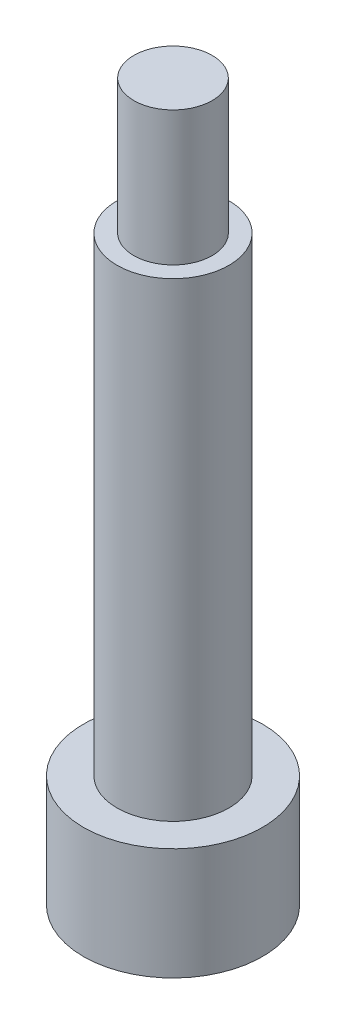
ISO-10303-21;
HEADER;
FILE_DESCRIPTION(('STEP AP214'),'2;1');
FILE_NAME('part.step','',(''),(''),'','','');
FILE_SCHEMA(('AUTOMOTIVE_DESIGN { 1 0 10303 214 1 1 1 1 }'));
ENDSEC;
DATA;
#1=APPLICATION_CONTEXT('core data for automotive mechanical design processes');
#2=APPLICATION_PROTOCOL_DEFINITION('international standard','automotive_design',2000,#1);
#3=PRODUCT_CONTEXT('',#1,'mechanical');
#4=PRODUCT('Part','Part','',(#3));
#5=PRODUCT_RELATED_PRODUCT_CATEGORY('part','',(#4));
#6=PRODUCT_DEFINITION_FORMATION('','',#4);
#7=PRODUCT_DEFINITION_CONTEXT('part definition',#1,'design');
#8=PRODUCT_DEFINITION('design','',#6,#7);
#9=PRODUCT_DEFINITION_SHAPE('','',#8);
#10=(LENGTH_UNIT() NAMED_UNIT(*) SI_UNIT(.MILLI.,.METRE.));
#11=(NAMED_UNIT(*) PLANE_ANGLE_UNIT() SI_UNIT($,.RADIAN.));
#12=(NAMED_UNIT(*) SI_UNIT($,.STERADIAN.) SOLID_ANGLE_UNIT());
#13=UNCERTAINTY_MEASURE_WITH_UNIT(LENGTH_MEASURE(1.E-05),#10,'distance_accuracy_value','');
#14=(GEOMETRIC_REPRESENTATION_CONTEXT(3) GLOBAL_UNCERTAINTY_ASSIGNED_CONTEXT((#13)) GLOBAL_UNIT_ASSIGNED_CONTEXT((#10,
#11,#12)) REPRESENTATION_CONTEXT('',''));
#15=CARTESIAN_POINT('',(0.,0.,0.));
#16=DIRECTION('',(0.,0.,1.));
#17=DIRECTION('',(1.,0.,0.));
#18=AXIS2_PLACEMENT_3D('',#15,#16,#17);
#19=CARTESIAN_POINT('',(0.,10.,0.));
#20=DIRECTION('',(0.,-1.,0.));
#21=DIRECTION('',(0.,0.,-1.));
#22=AXIS2_PLACEMENT_3D('',#19,#20,#21);
#23=CYLINDRICAL_SURFACE('',#22,8.);
#24=CARTESIAN_POINT('',(0.,10.,0.));
#25=DIRECTION('',(0.,1.,0.));
#26=DIRECTION('',(0.,0.,1.));
#27=AXIS2_PLACEMENT_3D('',#24,#25,#26);
#28=CIRCLE('',#27,8.);
#29=CARTESIAN_POINT('',(0.,10.,8.));
#30=VERTEX_POINT('',#29);
#31=EDGE_CURVE('E122',#30,#30,#28,.T.);
#32=ORIENTED_EDGE('',*,*,#31,.F.);
#33=EDGE_LOOP('',(#32));
#34=FACE_BOUND('',#33,.T.);
#35=CARTESIAN_POINT('',(0.,0.,0.));
#36=DIRECTION('',(0.,1.,0.));
#37=DIRECTION('',(0.,0.,1.));
#38=AXIS2_PLACEMENT_3D('',#35,#36,#37);
#39=CIRCLE('',#38,8.);
#40=CARTESIAN_POINT('',(0.,0.,8.));
#41=VERTEX_POINT('',#40);
#42=EDGE_CURVE('E119',#41,#41,#39,.T.);
#43=ORIENTED_EDGE('',*,*,#42,.T.);
#44=EDGE_LOOP('',(#43));
#45=FACE_BOUND('',#44,.T.);
#46=ADVANCED_FACE('F38',(#34,#45),#23,.T.);
#47=CARTESIAN_POINT('',(0.,10.,0.));
#48=DIRECTION('',(0.,1.,0.));
#49=DIRECTION('',(0.,0.,1.));
#50=AXIS2_PLACEMENT_3D('',#47,#48,#49);
#51=PLANE('',#50);
#52=CARTESIAN_POINT('',(0.,10.,0.));
#53=DIRECTION('',(0.,1.,0.));
#54=DIRECTION('',(0.,0.,1.));
#55=AXIS2_PLACEMENT_3D('',#52,#53,#54);
#56=CIRCLE('',#55,5.);
#57=CARTESIAN_POINT('',(0.,10.,5.));
#58=VERTEX_POINT('',#57);
#59=EDGE_CURVE('E116',#58,#58,#56,.T.);
#60=ORIENTED_EDGE('',*,*,#59,.F.);
#61=EDGE_LOOP('',(#60));
#62=FACE_BOUND('',#61,.T.);
#63=ORIENTED_EDGE('',*,*,#31,.T.);
#64=EDGE_LOOP('',(#63));
#65=FACE_BOUND('',#64,.T.);
#66=ADVANCED_FACE('F170',(#62,#65),#51,.T.);
#67=CARTESIAN_POINT('',(0.,0.,0.));
#68=DIRECTION('',(0.,1.,0.));
#69=DIRECTION('',(0.,0.,1.));
#70=AXIS2_PLACEMENT_3D('',#67,#68,#69);
#71=PLANE('',#70);
#72=ORIENTED_EDGE('',*,*,#42,.F.);
#73=EDGE_LOOP('',(#72));
#74=FACE_BOUND('',#73,.T.);
#75=ADVANCED_FACE('F165',(#74),#71,.F.);
#76=CARTESIAN_POINT('',(0.,52.,0.));
#77=DIRECTION('',(0.,-1.,0.));
#78=DIRECTION('',(0.,0.,-1.));
#79=AXIS2_PLACEMENT_3D('',#76,#77,#78);
#80=CYLINDRICAL_SURFACE('',#79,5.);
#81=DIRECTION('',(0.,-1.,0.));
#82=VECTOR('',#81,1.);
#83=CARTESIAN_POINT('',(-4.58257569495584,52.,2.));
#84=LINE('',#83,#82);
#85=CARTESIAN_POINT('',(-4.58257569495584,48.,2.));
#86=VERTEX_POINT('',#85);
#87=CARTESIAN_POINT('',(-4.58257569495584,42.,2.));
#88=VERTEX_POINT('',#87);
#89=EDGE_CURVE('E51',#86,#88,#84,.T.);
#90=ORIENTED_EDGE('',*,*,#89,.T.);
#91=CARTESIAN_POINT('',(-4.58257569495584,42.,2.));
#92=CARTESIAN_POINT('',(-4.58256464470381,41.9461941474974,2.00000798036348));
#93=CARTESIAN_POINT('',(-4.58352306077323,41.8923943344424,1.99782891366025));
#94=CARTESIAN_POINT('',(-4.58729625417543,41.7852287017453,1.98915905973447));
#95=CARTESIAN_POINT('',(-4.59011032448545,41.731862724644,1.98266991468793));
#96=CARTESIAN_POINT('',(-4.59749782920639,41.6261531784412,1.9654760367637));
#97=CARTESIAN_POINT('',(-4.60206430717533,41.573806415956,1.95478796820434));
#98=CARTESIAN_POINT('',(-4.61280053296682,41.4702992282855,1.92931630190661));
#99=CARTESIAN_POINT('',(-4.61897037865398,41.4191388757228,1.91453245417091));
#100=CARTESIAN_POINT('',(-4.63959291248421,41.268064149418,1.86426971793523));
#101=CARTESIAN_POINT('',(-4.6561744915743,41.1703457693103,1.82284489460008));
#102=CARTESIAN_POINT('',(-4.6931237076538,40.9832044199174,1.72548191592177));
#103=CARTESIAN_POINT('',(-4.71349493864007,40.8937894470384,1.66952996336926));
#104=CARTESIAN_POINT('',(-4.75700999402114,40.7207376033258,1.54131835736855));
#105=CARTESIAN_POINT('',(-4.78024245635516,40.6376327830798,1.46836913992731));
#106=CARTESIAN_POINT('',(-4.82612790548656,40.4844597277893,1.30969646176209));
#107=CARTESIAN_POINT('',(-4.84878077249721,40.4143941691343,1.22397038499682));
#108=CARTESIAN_POINT('',(-4.89203417106082,40.2865936058044,1.03800590808969));
#109=CARTESIAN_POINT('',(-4.91251824543531,40.2294551907381,0.937327933050966));
#110=CARTESIAN_POINT('',(-4.94803944125004,40.1331559273114,0.726824143246716));
#111=CARTESIAN_POINT('',(-4.96307883544185,40.0939875759483,0.617002169026251));
#112=CARTESIAN_POINT('',(-4.98538314653816,40.0366587986894,0.396967441295698));
#113=CARTESIAN_POINT('',(-4.99298922547927,40.0175730490943,0.287031054523066));
#114=CARTESIAN_POINT('',(-5.00080310201086,39.9979715200544,0.0652684304565211));
#115=CARTESIAN_POINT('',(-5.0010135205303,39.9974491619765,-0.04655712328416));
#116=CARTESIAN_POINT('',(-4.99421960045302,40.0144828391599,-0.262233376226779));
#117=CARTESIAN_POINT('',(-4.98761985585461,40.031025046674,-0.366179202506787));
#118=CARTESIAN_POINT('',(-4.96849270441446,40.0799934270535,-0.569674786500925));
#119=CARTESIAN_POINT('',(-4.95596496209929,40.1124204988686,-0.669224295072838));
#120=CARTESIAN_POINT('',(-4.92596830598785,40.1926362964245,-0.86289753907029));
#121=CARTESIAN_POINT('',(-4.90842774755848,40.2406492408105,-0.956916851366435));
#122=CARTESIAN_POINT('',(-4.87014602008043,40.3504645885951,-1.13580746919776));
#123=CARTESIAN_POINT('',(-4.84940372896449,40.4122718296906,-1.22067554984697));
#124=CARTESIAN_POINT('',(-4.80521782746144,40.5526441802585,-1.38476339273627));
#125=CARTESIAN_POINT('',(-4.78168627172884,40.63204247467,-1.46324770308939));
#126=CARTESIAN_POINT('',(-4.7356195058465,40.8029800951477,-1.60609926099478));
#127=CARTESIAN_POINT('',(-4.71308475332783,40.8945249220943,-1.67046007709005));
#128=CARTESIAN_POINT('',(-4.67095688856025,41.0904702840212,-1.78493657933605));
#129=CARTESIAN_POINT('',(-4.65146702150583,41.1951648366602,-1.83458932217622));
#130=CARTESIAN_POINT('',(-4.61886105059582,41.4123615244295,-1.91521298357264));
#131=CARTESIAN_POINT('',(-4.60573367628738,41.5248494473383,-1.94621696002208));
#132=CARTESIAN_POINT('',(-4.59208303529493,41.698743634158,-1.9781058182572));
#133=CARTESIAN_POINT('',(-4.58853437680526,41.7586575493013,-1.98630505165979));
#134=CARTESIAN_POINT('',(-4.58377540314388,41.8790350189955,-1.99725282103812));
#135=CARTESIAN_POINT('',(-4.58256364711744,41.9394982117578,-2.00000471568568));
#136=CARTESIAN_POINT('',(-4.58257569495584,42.,-2.));
#137=B_SPLINE_CURVE_WITH_KNOTS('',3,(#91,#92,#93,#94,#95,#96,#97,#98,#99,#100,#101,#102,#103,
#104,#105,#106,#107,#108,#109,#110,#111,#112,#113,#114,#115,#116,#117,#118,#119,#120,#121,#122,
#123,#124,#125,#126,#127,#128,#129,#130,#131,#132,#133,#134,#135,#136),.UNSPECIFIED.,.F.,.F.,(4,
2,2,2,2,2,2,2,2,2,2,2,2,2,2,2,2,2,2,2,2,2,4),(0.,0.161354853098824,0.322648263883208,
0.483307911251883,0.643977367092303,0.964683001739086,1.28569434942625,1.62318047995497,
1.96073580539191,2.31162858925763,2.66237473197322,2.99613876504269,3.32978451514655,
3.64468915259535,3.95961161305654,4.27928176927546,4.59906421133018,4.93981874675153,
5.28072813203933,5.63144241548461,5.98153315592124,6.16300192557813,6.34435877193561),.UNSPECIFIED.);
#138=CARTESIAN_POINT('',(-4.58257569495584,42.,-2.));
#139=VERTEX_POINT('',#138);
#140=EDGE_CURVE('E11',#88,#139,#137,.T.);
#141=ORIENTED_EDGE('',*,*,#140,.T.);
#142=DIRECTION('',(0.,-1.,0.));
#143=VECTOR('',#142,1.);
#144=CARTESIAN_POINT('',(-4.58257569495584,52.,-2.));
#145=LINE('',#144,#143);
#146=CARTESIAN_POINT('',(-4.58257569495584,48.,-2.));
#147=VERTEX_POINT('',#146);
#148=EDGE_CURVE('E85',#139,#147,#145,.F.);
#149=ORIENTED_EDGE('',*,*,#148,.T.);
#150=CARTESIAN_POINT('',(-4.58257569495584,48.,-2.));
#151=CARTESIAN_POINT('',(-4.58256464470381,48.0538058525026,-2.00000798036347));
#152=CARTESIAN_POINT('',(-4.58352306077323,48.1076056655576,-1.99782891366025));
#153=CARTESIAN_POINT('',(-4.58729625417543,48.2147712982547,-1.98915905973447));
#154=CARTESIAN_POINT('',(-4.59011032448545,48.268137275356,-1.98266991468793));
#155=CARTESIAN_POINT('',(-4.59749782920639,48.3738468215588,-1.9654760367637));
#156=CARTESIAN_POINT('',(-4.60206430717533,48.426193584044,-1.95478796820434));
#157=CARTESIAN_POINT('',(-4.61280053296682,48.5297007717145,-1.9293163019066));
#158=CARTESIAN_POINT('',(-4.61897037865398,48.5808611242772,-1.91453245417091));
#159=CARTESIAN_POINT('',(-4.63959291248421,48.731935850582,-1.86426971793523));
#160=CARTESIAN_POINT('',(-4.6561744915743,48.8296542306897,-1.82284489460008));
#161=CARTESIAN_POINT('',(-4.6931237076538,49.0167955800826,-1.72548191592176));
#162=CARTESIAN_POINT('',(-4.71349493864007,49.1062105529617,-1.66952996336926));
#163=CARTESIAN_POINT('',(-4.75700999402114,49.2792623966742,-1.54131835736855));
#164=CARTESIAN_POINT('',(-4.78024245635516,49.3623672169202,-1.4683691399273));
#165=CARTESIAN_POINT('',(-4.82612790548656,49.5155402722107,-1.30969646176209));
#166=CARTESIAN_POINT('',(-4.84878077249721,49.5856058308657,-1.22397038499682));
#167=CARTESIAN_POINT('',(-4.89203417106082,49.7134063941956,-1.03800590808969));
#168=CARTESIAN_POINT('',(-4.91251824543531,49.7705448092619,-0.93732793305097));
#169=CARTESIAN_POINT('',(-4.94803944125004,49.8668440726886,-0.726824143246718));
#170=CARTESIAN_POINT('',(-4.96307883544185,49.9060124240517,-0.617002169026251));
#171=CARTESIAN_POINT('',(-4.98538314653816,49.9633412013106,-0.396967441295697));
#172=CARTESIAN_POINT('',(-4.99298922547927,49.9824269509057,-0.287031054523065));
#173=CARTESIAN_POINT('',(-5.00080310201086,50.0020284799456,-0.0652684304565203));
#174=CARTESIAN_POINT('',(-5.0010135205303,50.0025508380235,0.0465571232841612));
#175=CARTESIAN_POINT('',(-4.99421960045302,49.9855171608401,0.262233376226781));
#176=CARTESIAN_POINT('',(-4.98761985585461,49.968974953326,0.366179202506789));
#177=CARTESIAN_POINT('',(-4.96849270441446,49.9200065729465,0.569674786500927));
#178=CARTESIAN_POINT('',(-4.95596496209929,49.8875795011314,0.66922429507284));
#179=CARTESIAN_POINT('',(-4.92596830598785,49.8073637035755,0.862897539070291));
#180=CARTESIAN_POINT('',(-4.90842774755848,49.7593507591895,0.956916851366434));
#181=CARTESIAN_POINT('',(-4.87014602008043,49.6495354114049,1.13580746919776));
#182=CARTESIAN_POINT('',(-4.84940372896448,49.5877281703094,1.22067554984697));
#183=CARTESIAN_POINT('',(-4.80521782746144,49.4473558197415,1.38476339273627));
#184=CARTESIAN_POINT('',(-4.78168627172884,49.36795752533,1.46324770308939));
#185=CARTESIAN_POINT('',(-4.7356195058465,49.1970199048523,1.60609926099477));
#186=CARTESIAN_POINT('',(-4.71308475332783,49.1054750779057,1.67046007709005));
#187=CARTESIAN_POINT('',(-4.67095688856025,48.9095297159788,1.78493657933605));
#188=CARTESIAN_POINT('',(-4.65146702150583,48.8048351633398,1.83458932217622));
#189=CARTESIAN_POINT('',(-4.61886105059582,48.5876384755705,1.91521298357264));
#190=CARTESIAN_POINT('',(-4.60573367628738,48.4751505526617,1.94621696002208));
#191=CARTESIAN_POINT('',(-4.59208303529493,48.301256365842,1.9781058182572));
#192=CARTESIAN_POINT('',(-4.58853437680526,48.2413424506987,1.98630505165979));
#193=CARTESIAN_POINT('',(-4.58377540314388,48.1209649810045,1.99725282103812));
#194=CARTESIAN_POINT('',(-4.58256364711744,48.0605017882422,2.00000471568568));
#195=CARTESIAN_POINT('',(-4.58257569495584,48.,2.));
#196=B_SPLINE_CURVE_WITH_KNOTS('',3,(#150,#151,#152,#153,#154,#155,#156,#157,#158,#159,#160,
#161,#162,#163,#164,#165,#166,#167,#168,#169,#170,#171,#172,#173,#174,#175,#176,#177,#178,#179,
#180,#181,#182,#183,#184,#185,#186,#187,#188,#189,#190,#191,#192,#193,#194,#195),.UNSPECIFIED.,
.F.,.F.,(4,2,2,2,2,2,2,2,2,2,2,2,2,2,2,2,2,2,2,2,2,2,4),(0.,0.161354853098824,0.322648263883208,
0.483307911251884,0.643977367092302,0.964683001739086,1.28569434942625,1.62318047995498,
1.9607358053919,2.31162858925763,2.66237473197322,2.99613876504269,3.32978451514655,
3.64468915259535,3.95961161305654,4.27928176927546,4.59906421133018,4.93981874675153,
5.28072813203933,5.63144241548462,5.98153315592124,6.16300192557814,6.34435877193561),.UNSPECIFIED.);
#197=EDGE_CURVE('E128',#147,#86,#196,.T.);
#198=ORIENTED_EDGE('',*,*,#197,.T.);
#199=EDGE_LOOP('',(#90,#141,#149,#198));
#200=FACE_BOUND('',#199,.T.);
#201=CARTESIAN_POINT('',(0.,52.,0.));
#202=DIRECTION('',(0.,1.,0.));
#203=DIRECTION('',(0.,0.,1.));
#204=AXIS2_PLACEMENT_3D('',#201,#202,#203);
#205=CIRCLE('',#204,5.);
#206=CARTESIAN_POINT('',(0.,52.,5.));
#207=VERTEX_POINT('',#206);
#208=EDGE_CURVE('E112',#207,#207,#205,.T.);
#209=ORIENTED_EDGE('',*,*,#208,.F.);
#210=EDGE_LOOP('',(#209));
#211=FACE_BOUND('',#210,.T.);
#212=ORIENTED_EDGE('',*,*,#59,.T.);
#213=EDGE_LOOP('',(#212));
#214=FACE_BOUND('',#213,.T.);
#215=ADVANCED_FACE('F135',(#200,#211,#214),#80,.T.);
#216=CARTESIAN_POINT('',(0.,52.,0.));
#217=DIRECTION('',(0.,1.,0.));
#218=DIRECTION('',(0.,0.,1.));
#219=AXIS2_PLACEMENT_3D('',#216,#217,#218);
#220=PLANE('',#219);
#221=CARTESIAN_POINT('',(0.,52.,0.));
#222=DIRECTION('',(0.,1.,0.));
#223=DIRECTION('',(0.,0.,1.));
#224=AXIS2_PLACEMENT_3D('',#221,#222,#223);
#225=CIRCLE('',#224,3.5);
#226=CARTESIAN_POINT('',(0.,52.,3.5));
#227=VERTEX_POINT('',#226);
#228=EDGE_CURVE('E113',#227,#227,#225,.T.);
#229=ORIENTED_EDGE('',*,*,#228,.F.);
#230=EDGE_LOOP('',(#229));
#231=FACE_BOUND('',#230,.T.);
#232=ORIENTED_EDGE('',*,*,#208,.T.);
#233=EDGE_LOOP('',(#232));
#234=FACE_BOUND('',#233,.T.);
#235=ADVANCED_FACE('F157',(#231,#234),#220,.T.);
#236=CARTESIAN_POINT('',(0.,64.,0.));
#237=DIRECTION('',(0.,-1.,0.));
#238=DIRECTION('',(0.,0.,-1.));
#239=AXIS2_PLACEMENT_3D('',#236,#237,#238);
#240=CYLINDRICAL_SURFACE('',#239,3.5);
#241=CARTESIAN_POINT('',(0.,64.,0.));
#242=DIRECTION('',(0.,1.,0.));
#243=DIRECTION('',(0.,0.,1.));
#244=AXIS2_PLACEMENT_3D('',#241,#242,#243);
#245=CIRCLE('',#244,3.5);
#246=CARTESIAN_POINT('',(0.,64.,3.5));
#247=VERTEX_POINT('',#246);
#248=EDGE_CURVE('E106',#247,#247,#245,.T.);
#249=ORIENTED_EDGE('',*,*,#248,.F.);
#250=EDGE_LOOP('',(#249));
#251=FACE_BOUND('',#250,.T.);
#252=ORIENTED_EDGE('',*,*,#228,.T.);
#253=EDGE_LOOP('',(#252));
#254=FACE_BOUND('',#253,.T.);
#255=ADVANCED_FACE('F154',(#251,#254),#240,.T.);
#256=CARTESIAN_POINT('',(0.,64.,0.));
#257=DIRECTION('',(0.,1.,0.));
#258=DIRECTION('',(0.,0.,1.));
#259=AXIS2_PLACEMENT_3D('',#256,#257,#258);
#260=PLANE('',#259);
#261=ORIENTED_EDGE('',*,*,#248,.T.);
#262=EDGE_LOOP('',(#261));
#263=FACE_BOUND('',#262,.T.);
#264=ADVANCED_FACE('F151',(#263),#260,.T.);
#265=CARTESIAN_POINT('',(-10.,42.,0.));
#266=DIRECTION('',(1.,0.,0.));
#267=DIRECTION('',(0.,0.,-1.));
#268=AXIS2_PLACEMENT_3D('',#265,#266,#267);
#269=CYLINDRICAL_SURFACE('',#268,2.);
#270=DIRECTION('',(1.,0.,0.));
#271=VECTOR('',#270,1.);
#272=CARTESIAN_POINT('',(-10.,42.,2.));
#273=LINE('',#272,#271);
#274=CARTESIAN_POINT('',(0.,42.,2.));
#275=VERTEX_POINT('',#274);
#276=EDGE_CURVE('E100',#88,#275,#273,.T.);
#277=ORIENTED_EDGE('',*,*,#276,.T.);
#278=CARTESIAN_POINT('',(0.,42.,0.));
#279=DIRECTION('',(1.,0.,0.));
#280=DIRECTION('',(0.,0.,-1.));
#281=AXIS2_PLACEMENT_3D('',#278,#279,#280);
#282=CIRCLE('',#281,2.);
#283=CARTESIAN_POINT('',(0.,42.,-2.));
#284=VERTEX_POINT('',#283);
#285=EDGE_CURVE('E94',#275,#284,#282,.T.);
#286=ORIENTED_EDGE('',*,*,#285,.T.);
#287=DIRECTION('',(1.,0.,0.));
#288=VECTOR('',#287,1.);
#289=CARTESIAN_POINT('',(-10.,42.,-2.));
#290=LINE('',#289,#288);
#291=EDGE_CURVE('E80',#139,#284,#290,.T.);
#292=ORIENTED_EDGE('',*,*,#291,.F.);
#293=ORIENTED_EDGE('',*,*,#140,.F.);
#294=EDGE_LOOP('',(#277,#286,#292,#293));
#295=FACE_BOUND('',#294,.T.);
#296=ADVANCED_FACE('F99',(#295),#269,.F.);
#297=CARTESIAN_POINT('',(-10.,42.,2.));
#298=DIRECTION('',(0.,0.,1.));
#299=DIRECTION('',(1.,0.,0.));
#300=AXIS2_PLACEMENT_3D('',#297,#298,#299);
#301=PLANE('',#300);
#302=DIRECTION('',(1.,0.,0.));
#303=VECTOR('',#302,1.);
#304=CARTESIAN_POINT('',(-10.,48.,2.));
#305=LINE('',#304,#303);
#306=CARTESIAN_POINT('',(0.,48.,2.));
#307=VERTEX_POINT('',#306);
#308=EDGE_CURVE('E107',#86,#307,#305,.T.);
#309=ORIENTED_EDGE('',*,*,#308,.T.);
#310=DIRECTION('',(0.,-1.,0.));
#311=VECTOR('',#310,1.);
#312=CARTESIAN_POINT('',(0.,42.,2.));
#313=LINE('',#312,#311);
#314=EDGE_CURVE('E87',#307,#275,#313,.T.);
#315=ORIENTED_EDGE('',*,*,#314,.T.);
#316=ORIENTED_EDGE('',*,*,#276,.F.);
#317=ORIENTED_EDGE('',*,*,#89,.F.);
#318=EDGE_LOOP('',(#309,#315,#316,#317));
#319=FACE_BOUND('',#318,.T.);
#320=ADVANCED_FACE('F144',(#319),#301,.F.);
#321=CARTESIAN_POINT('',(-10.,48.,0.));
#322=DIRECTION('',(1.,0.,0.));
#323=DIRECTION('',(0.,0.,-1.));
#324=AXIS2_PLACEMENT_3D('',#321,#322,#323);
#325=CYLINDRICAL_SURFACE('',#324,2.);
#326=DIRECTION('',(1.,0.,0.));
#327=VECTOR('',#326,1.);
#328=CARTESIAN_POINT('',(-10.,48.,-2.));
#329=LINE('',#328,#327);
#330=CARTESIAN_POINT('',(0.,48.,-2.));
#331=VERTEX_POINT('',#330);
#332=EDGE_CURVE('E58',#147,#331,#329,.T.);
#333=ORIENTED_EDGE('',*,*,#332,.T.);
#334=CARTESIAN_POINT('',(0.,48.,0.));
#335=DIRECTION('',(1.,0.,0.));
#336=DIRECTION('',(0.,0.,-1.));
#337=AXIS2_PLACEMENT_3D('',#334,#335,#336);
#338=CIRCLE('',#337,2.);
#339=EDGE_CURVE('E97',#331,#307,#338,.T.);
#340=ORIENTED_EDGE('',*,*,#339,.T.);
#341=ORIENTED_EDGE('',*,*,#308,.F.);
#342=ORIENTED_EDGE('',*,*,#197,.F.);
#343=EDGE_LOOP('',(#333,#340,#341,#342));
#344=FACE_BOUND('',#343,.T.);
#345=ADVANCED_FACE('F139',(#344),#325,.F.);
#346=CARTESIAN_POINT('',(-10.,42.,-2.));
#347=DIRECTION('',(0.,0.,-1.));
#348=DIRECTION('',(-1.,0.,0.));
#349=AXIS2_PLACEMENT_3D('',#346,#347,#348);
#350=PLANE('',#349);
#351=ORIENTED_EDGE('',*,*,#291,.T.);
#352=DIRECTION('',(0.,1.,0.));
#353=VECTOR('',#352,1.);
#354=CARTESIAN_POINT('',(0.,42.,-2.));
#355=LINE('',#354,#353);
#356=EDGE_CURVE('E83',#284,#331,#355,.T.);
#357=ORIENTED_EDGE('',*,*,#356,.T.);
#358=ORIENTED_EDGE('',*,*,#332,.F.);
#359=ORIENTED_EDGE('',*,*,#148,.F.);
#360=EDGE_LOOP('',(#351,#357,#358,#359));
#361=FACE_BOUND('',#360,.T.);
#362=ADVANCED_FACE('F82',(#361),#350,.F.);
#363=CARTESIAN_POINT('',(0.,42.,0.));
#364=DIRECTION('',(1.,0.,0.));
#365=DIRECTION('',(0.,0.,-1.));
#366=AXIS2_PLACEMENT_3D('',#363,#364,#365);
#367=PLANE('',#366);
#368=ORIENTED_EDGE('',*,*,#285,.F.);
#369=ORIENTED_EDGE('',*,*,#314,.F.);
#370=ORIENTED_EDGE('',*,*,#339,.F.);
#371=ORIENTED_EDGE('',*,*,#356,.F.);
#372=EDGE_LOOP('',(#368,#369,#370,#371));
#373=FACE_BOUND('',#372,.T.);
#374=ADVANCED_FACE('F92',(#373),#367,.F.);
#375=CLOSED_SHELL('',(#46,#66,#75,#215,#235,#255,#264,#296,#320,#345,#362,#374));
#376=MANIFOLD_SOLID_BREP('B2',#375);
#377=ADVANCED_BREP_SHAPE_REPRESENTATION('',(#18,#376),#14);
#378=SHAPE_DEFINITION_REPRESENTATION(#9,#377);
ENDSEC;
END-ISO-10303-21;
